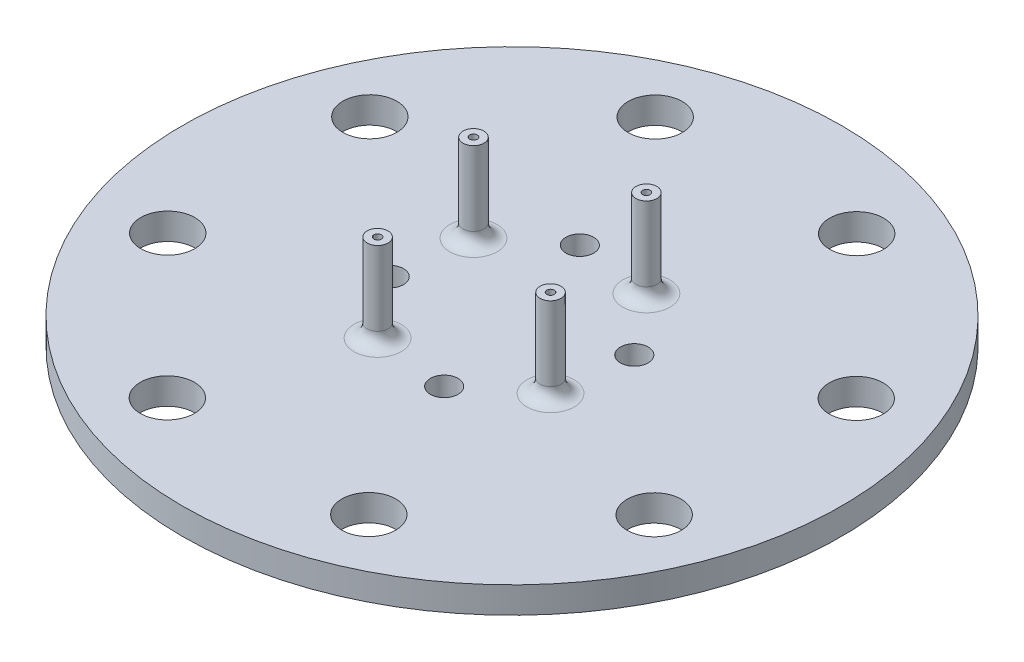
ISO-10303-21;
HEADER;
FILE_DESCRIPTION(('STEP AP214'),'2;1');
FILE_NAME('part.step','',(''),(''),'','','');
FILE_SCHEMA(('AUTOMOTIVE_DESIGN { 1 0 10303 214 1 1 1 1 }'));
ENDSEC;
DATA;
#1=APPLICATION_CONTEXT('core data for automotive mechanical design processes');
#2=APPLICATION_PROTOCOL_DEFINITION('international standard','automotive_design',2000,#1);
#3=PRODUCT_CONTEXT('',#1,'mechanical');
#4=PRODUCT('Part','Part','',(#3));
#5=PRODUCT_RELATED_PRODUCT_CATEGORY('part','',(#4));
#6=PRODUCT_DEFINITION_FORMATION('','',#4);
#7=PRODUCT_DEFINITION_CONTEXT('part definition',#1,'design');
#8=PRODUCT_DEFINITION('design','',#6,#7);
#9=PRODUCT_DEFINITION_SHAPE('','',#8);
#10=(LENGTH_UNIT() NAMED_UNIT(*) SI_UNIT(.MILLI.,.METRE.));
#11=(NAMED_UNIT(*) PLANE_ANGLE_UNIT() SI_UNIT($,.RADIAN.));
#12=(NAMED_UNIT(*) SI_UNIT($,.STERADIAN.) SOLID_ANGLE_UNIT());
#13=UNCERTAINTY_MEASURE_WITH_UNIT(LENGTH_MEASURE(1.E-05),#10,'distance_accuracy_value','');
#14=(GEOMETRIC_REPRESENTATION_CONTEXT(3) GLOBAL_UNCERTAINTY_ASSIGNED_CONTEXT((#13)) GLOBAL_UNIT_ASSIGNED_CONTEXT((#10,
#11,#12)) REPRESENTATION_CONTEXT('',''));
#15=CARTESIAN_POINT('',(0.,0.,0.));
#16=DIRECTION('',(0.,0.,1.));
#17=DIRECTION('',(1.,0.,0.));
#18=AXIS2_PLACEMENT_3D('',#15,#16,#17);
#19=CARTESIAN_POINT('',(3.63690117331167,3.,-6.55918820095629));
#20=DIRECTION('',(0.,1.,0.));
#21=DIRECTION('',(0.,0.,1.));
#22=AXIS2_PLACEMENT_3D('',#19,#20,#21);
#23=TOROIDAL_SURFACE('',#22,1.79375,1.);
#24=CARTESIAN_POINT('',(3.63690117331167,3.,-6.55918820095629));
#25=DIRECTION('',(0.,1.,0.));
#26=DIRECTION('',(0.,0.,1.));
#27=AXIS2_PLACEMENT_3D('',#24,#25,#26);
#28=CIRCLE('',#27,0.79375);
#29=CARTESIAN_POINT('',(3.63690117331167,3.,-5.76543820095629));
#30=VERTEX_POINT('',#29);
#31=EDGE_CURVE('E48',#30,#30,#28,.T.);
#32=ORIENTED_EDGE('',*,*,#31,.F.);
#33=EDGE_LOOP('',(#32));
#34=FACE_BOUND('',#33,.T.);
#35=CARTESIAN_POINT('',(3.63690117331167,2.,-6.55918820095629));
#36=DIRECTION('',(0.,1.,0.));
#37=DIRECTION('',(0.,0.,1.));
#38=AXIS2_PLACEMENT_3D('',#35,#36,#37);
#39=CIRCLE('',#38,1.79375);
#40=CARTESIAN_POINT('',(3.63690117331167,2.,-4.76543820095629));
#41=VERTEX_POINT('',#40);
#42=EDGE_CURVE('E10',#41,#41,#39,.F.);
#43=ORIENTED_EDGE('',*,*,#42,.F.);
#44=EDGE_LOOP('',(#43));
#45=FACE_BOUND('',#44,.T.);
#46=ADVANCED_FACE('F41',(#34,#45),#23,.F.);
#47=CARTESIAN_POINT('',(6.55918820095628,3.,3.63690117331169));
#48=DIRECTION('',(0.,1.,0.));
#49=DIRECTION('',(0.,0.,1.));
#50=AXIS2_PLACEMENT_3D('',#47,#48,#49);
#51=TOROIDAL_SURFACE('',#50,1.79375,1.);
#52=CARTESIAN_POINT('',(6.55918820095628,3.,3.63690117331169));
#53=DIRECTION('',(0.,1.,0.));
#54=DIRECTION('',(0.,0.,1.));
#55=AXIS2_PLACEMENT_3D('',#52,#53,#54);
#56=CIRCLE('',#55,0.79375);
#57=CARTESIAN_POINT('',(6.55918820095628,3.,4.43065117331169));
#58=VERTEX_POINT('',#57);
#59=EDGE_CURVE('E58',#58,#58,#56,.T.);
#60=ORIENTED_EDGE('',*,*,#59,.F.);
#61=EDGE_LOOP('',(#60));
#62=FACE_BOUND('',#61,.T.);
#63=CARTESIAN_POINT('',(6.55918820095628,2.,3.63690117331169));
#64=DIRECTION('',(0.,1.,0.));
#65=DIRECTION('',(0.,0.,1.));
#66=AXIS2_PLACEMENT_3D('',#63,#64,#65);
#67=CIRCLE('',#66,1.79375);
#68=CARTESIAN_POINT('',(6.55918820095628,2.,5.43065117331169));
#69=VERTEX_POINT('',#68);
#70=EDGE_CURVE('E53',#69,#69,#67,.F.);
#71=ORIENTED_EDGE('',*,*,#70,.F.);
#72=EDGE_LOOP('',(#71));
#73=FACE_BOUND('',#72,.T.);
#74=ADVANCED_FACE('F249',(#62,#73),#51,.F.);
#75=CARTESIAN_POINT('',(-3.63690117331162,3.,6.55918820095631));
#76=DIRECTION('',(0.,1.,0.));
#77=DIRECTION('',(0.,0.,1.));
#78=AXIS2_PLACEMENT_3D('',#75,#76,#77);
#79=TOROIDAL_SURFACE('',#78,1.79375,1.);
#80=CARTESIAN_POINT('',(-3.63690117331162,3.,6.55918820095631));
#81=DIRECTION('',(0.,1.,0.));
#82=DIRECTION('',(0.,0.,1.));
#83=AXIS2_PLACEMENT_3D('',#80,#81,#82);
#84=CIRCLE('',#83,0.793750000000001);
#85=CARTESIAN_POINT('',(-3.63690117331162,3.,7.35293820095631));
#86=VERTEX_POINT('',#85);
#87=EDGE_CURVE('E68',#86,#86,#84,.T.);
#88=ORIENTED_EDGE('',*,*,#87,.F.);
#89=EDGE_LOOP('',(#88));
#90=FACE_BOUND('',#89,.T.);
#91=CARTESIAN_POINT('',(-3.63690117331162,2.,6.55918820095631));
#92=DIRECTION('',(0.,1.,0.));
#93=DIRECTION('',(0.,0.,1.));
#94=AXIS2_PLACEMENT_3D('',#91,#92,#93);
#95=CIRCLE('',#94,1.79375);
#96=CARTESIAN_POINT('',(-3.63690117331162,2.,8.35293820095631));
#97=VERTEX_POINT('',#96);
#98=EDGE_CURVE('E64',#97,#97,#95,.F.);
#99=ORIENTED_EDGE('',*,*,#98,.F.);
#100=EDGE_LOOP('',(#99));
#101=FACE_BOUND('',#100,.T.);
#102=ADVANCED_FACE('F255',(#90,#101),#79,.F.);
#103=CARTESIAN_POINT('',(-6.5591882009563,3.,-3.63690117331165));
#104=DIRECTION('',(0.,1.,0.));
#105=DIRECTION('',(0.,0.,1.));
#106=AXIS2_PLACEMENT_3D('',#103,#104,#105);
#107=TOROIDAL_SURFACE('',#106,1.79375,1.);
#108=CARTESIAN_POINT('',(-6.5591882009563,3.,-3.63690117331165));
#109=DIRECTION('',(0.,1.,0.));
#110=DIRECTION('',(0.,0.,1.));
#111=AXIS2_PLACEMENT_3D('',#108,#109,#110);
#112=CIRCLE('',#111,0.79375);
#113=CARTESIAN_POINT('',(-6.5591882009563,3.,-2.84315117331165));
#114=VERTEX_POINT('',#113);
#115=EDGE_CURVE('E76',#114,#114,#112,.T.);
#116=ORIENTED_EDGE('',*,*,#115,.F.);
#117=EDGE_LOOP('',(#116));
#118=FACE_BOUND('',#117,.T.);
#119=CARTESIAN_POINT('',(-6.5591882009563,2.,-3.63690117331165));
#120=DIRECTION('',(0.,1.,0.));
#121=DIRECTION('',(0.,0.,1.));
#122=AXIS2_PLACEMENT_3D('',#119,#120,#121);
#123=CIRCLE('',#122,1.79375);
#124=CARTESIAN_POINT('',(-6.5591882009563,2.,-1.84315117331165));
#125=VERTEX_POINT('',#124);
#126=EDGE_CURVE('E72',#125,#125,#123,.F.);
#127=ORIENTED_EDGE('',*,*,#126,.F.);
#128=EDGE_LOOP('',(#127));
#129=FACE_BOUND('',#128,.T.);
#130=ADVANCED_FACE('F261',(#118,#129),#107,.F.);
#131=CARTESIAN_POINT('',(0.,2.,0.));
#132=DIRECTION('',(0.,-1.,0.));
#133=DIRECTION('',(0.,0.,-1.));
#134=AXIS2_PLACEMENT_3D('',#131,#132,#133);
#135=CYLINDRICAL_SURFACE('',#134,25.);
#136=CARTESIAN_POINT('',(0.,2.,0.));
#137=DIRECTION('',(0.,1.,0.));
#138=DIRECTION('',(0.,0.,1.));
#139=AXIS2_PLACEMENT_3D('',#136,#137,#138);
#140=CIRCLE('',#139,25.);
#141=CARTESIAN_POINT('',(0.,2.,25.));
#142=VERTEX_POINT('',#141);
#143=EDGE_CURVE('E80',#142,#142,#140,.T.);
#144=ORIENTED_EDGE('',*,*,#143,.F.);
#145=EDGE_LOOP('',(#144));
#146=FACE_BOUND('',#145,.T.);
#147=CARTESIAN_POINT('',(0.,0.,0.));
#148=DIRECTION('',(0.,1.,0.));
#149=DIRECTION('',(0.,0.,1.));
#150=AXIS2_PLACEMENT_3D('',#147,#148,#149);
#151=CIRCLE('',#150,25.);
#152=CARTESIAN_POINT('',(0.,0.,25.));
#153=VERTEX_POINT('',#152);
#154=EDGE_CURVE('E81',#153,#153,#151,.T.);
#155=ORIENTED_EDGE('',*,*,#154,.T.);
#156=EDGE_LOOP('',(#155));
#157=FACE_BOUND('',#156,.T.);
#158=ADVANCED_FACE('F269',(#146,#157),#135,.T.);
#159=CARTESIAN_POINT('',(0.,2.,0.));
#160=DIRECTION('',(0.,1.,0.));
#161=DIRECTION('',(0.,0.,1.));
#162=AXIS2_PLACEMENT_3D('',#159,#160,#161);
#163=PLANE('',#162);
#164=ORIENTED_EDGE('',*,*,#42,.T.);
#165=EDGE_LOOP('',(#164));
#166=FACE_BOUND('',#165,.T.);
#167=ORIENTED_EDGE('',*,*,#70,.T.);
#168=EDGE_LOOP('',(#167));
#169=FACE_BOUND('',#168,.T.);
#170=ORIENTED_EDGE('',*,*,#98,.T.);
#171=EDGE_LOOP('',(#170));
#172=FACE_BOUND('',#171,.T.);
#173=ORIENTED_EDGE('',*,*,#126,.T.);
#174=EDGE_LOOP('',(#173));
#175=FACE_BOUND('',#174,.T.);
#176=CARTESIAN_POINT('',(-7.68064256948644,2.,18.4663946053315));
#177=DIRECTION('',(0.,-1.,0.));
#178=DIRECTION('',(0.,0.,-1.));
#179=AXIS2_PLACEMENT_3D('',#176,#177,#178);
#180=CIRCLE('',#179,2.05);
#181=CARTESIAN_POINT('',(-7.68064256948644,2.,16.4163946053315));
#182=VERTEX_POINT('',#181);
#183=EDGE_CURVE('E125',#182,#182,#180,.T.);
#184=ORIENTED_EDGE('',*,*,#183,.T.);
#185=EDGE_LOOP('',(#184));
#186=FACE_BOUND('',#185,.T.);
#187=CARTESIAN_POINT('',(7.62667840474221,2.,18.488747294251));
#188=DIRECTION('',(0.,-1.,0.));
#189=DIRECTION('',(0.,0.,-1.));
#190=AXIS2_PLACEMENT_3D('',#187,#188,#189);
#191=CIRCLE('',#190,2.05);
#192=CARTESIAN_POINT('',(7.62667840474221,2.,16.438747294251));
#193=VERTEX_POINT('',#192);
#194=EDGE_CURVE('E150',#193,#193,#191,.T.);
#195=ORIENTED_EDGE('',*,*,#194,.T.);
#196=EDGE_LOOP('',(#195));
#197=FACE_BOUND('',#196,.T.);
#198=CARTESIAN_POINT('',(18.4663946053311,2.,7.68064256948754));
#199=DIRECTION('',(0.,-1.,0.));
#200=DIRECTION('',(0.,0.,-1.));
#201=AXIS2_PLACEMENT_3D('',#198,#199,#200);
#202=CIRCLE('',#201,2.05);
#203=CARTESIAN_POINT('',(18.4663946053311,2.,5.63064256948754));
#204=VERTEX_POINT('',#203);
#205=EDGE_CURVE('E142',#204,#204,#202,.T.);
#206=ORIENTED_EDGE('',*,*,#205,.T.);
#207=EDGE_LOOP('',(#206));
#208=FACE_BOUND('',#207,.T.);
#209=CARTESIAN_POINT('',(18.4887472942505,2.,-7.62667840474111));
#210=DIRECTION('',(0.,-1.,0.));
#211=DIRECTION('',(0.,0.,-1.));
#212=AXIS2_PLACEMENT_3D('',#209,#210,#211);
#213=CIRCLE('',#212,2.05);
#214=CARTESIAN_POINT('',(18.4887472942505,2.,-9.67667840474111));
#215=VERTEX_POINT('',#214);
#216=EDGE_CURVE('E133',#215,#215,#213,.T.);
#217=ORIENTED_EDGE('',*,*,#216,.T.);
#218=EDGE_LOOP('',(#217));
#219=FACE_BOUND('',#218,.T.);
#220=CARTESIAN_POINT('',(7.6806425694871,2.,-18.46639460533));
#221=DIRECTION('',(0.,-1.,0.));
#222=DIRECTION('',(0.,0.,-1.));
#223=AXIS2_PLACEMENT_3D('',#220,#221,#222);
#224=CIRCLE('',#223,2.05);
#225=CARTESIAN_POINT('',(7.6806425694871,2.,-20.51639460533));
#226=VERTEX_POINT('',#225);
#227=EDGE_CURVE('E134',#226,#226,#224,.T.);
#228=ORIENTED_EDGE('',*,*,#227,.T.);
#229=EDGE_LOOP('',(#228));
#230=FACE_BOUND('',#229,.T.);
#231=CARTESIAN_POINT('',(-7.62667840474155,2.,-18.4887472942494));
#232=DIRECTION('',(0.,-1.,0.));
#233=DIRECTION('',(0.,0.,-1.));
#234=AXIS2_PLACEMENT_3D('',#231,#232,#233);
#235=CIRCLE('',#234,2.05);
#236=CARTESIAN_POINT('',(-7.62667840474155,2.,-20.5387472942494));
#237=VERTEX_POINT('',#236);
#238=EDGE_CURVE('E174',#237,#237,#235,.T.);
#239=ORIENTED_EDGE('',*,*,#238,.T.);
#240=EDGE_LOOP('',(#239));
#241=FACE_BOUND('',#240,.T.);
#242=CARTESIAN_POINT('',(-18.4663946053304,2.,-7.68064256948599));
#243=DIRECTION('',(0.,-1.,0.));
#244=DIRECTION('',(0.,0.,-1.));
#245=AXIS2_PLACEMENT_3D('',#242,#243,#244);
#246=CIRCLE('',#245,2.05);
#247=CARTESIAN_POINT('',(-18.4663946053304,2.,-9.73064256948599));
#248=VERTEX_POINT('',#247);
#249=EDGE_CURVE('E165',#248,#248,#246,.T.);
#250=ORIENTED_EDGE('',*,*,#249,.T.);
#251=EDGE_LOOP('',(#250));
#252=FACE_BOUND('',#251,.T.);
#253=CARTESIAN_POINT('',(-18.4887472942499,2.,7.62667840474266));
#254=DIRECTION('',(0.,-1.,0.));
#255=DIRECTION('',(0.,0.,-1.));
#256=AXIS2_PLACEMENT_3D('',#253,#254,#255);
#257=CIRCLE('',#256,2.05);
#258=CARTESIAN_POINT('',(-18.4887472942499,2.,5.57667840474266));
#259=VERTEX_POINT('',#258);
#260=EDGE_CURVE('E110',#259,#259,#257,.T.);
#261=ORIENTED_EDGE('',*,*,#260,.T.);
#262=EDGE_LOOP('',(#261));
#263=FACE_BOUND('',#262,.T.);
#264=CARTESIAN_POINT('',(-7.20972393812874,2.,2.06636897382066));
#265=DIRECTION('',(0.,1.,0.));
#266=DIRECTION('',(0.,0.,1.));
#267=AXIS2_PLACEMENT_3D('',#264,#265,#266);
#268=CIRCLE('',#267,1.05);
#269=CARTESIAN_POINT('',(-7.20972393812874,2.,3.11636897382066));
#270=VERTEX_POINT('',#269);
#271=EDGE_CURVE('E105',#270,#270,#268,.T.);
#272=ORIENTED_EDGE('',*,*,#271,.F.);
#273=EDGE_LOOP('',(#272));
#274=FACE_BOUND('',#273,.T.);
#275=CARTESIAN_POINT('',(2.06636897382105,2.,7.20972393812896));
#276=DIRECTION('',(0.,1.,0.));
#277=DIRECTION('',(0.,0.,1.));
#278=AXIS2_PLACEMENT_3D('',#275,#276,#277);
#279=CIRCLE('',#278,1.05);
#280=CARTESIAN_POINT('',(2.06636897382105,2.,8.25972393812896));
#281=VERTEX_POINT('',#280);
#282=EDGE_CURVE('E114',#281,#281,#279,.T.);
#283=ORIENTED_EDGE('',*,*,#282,.F.);
#284=EDGE_LOOP('',(#283));
#285=FACE_BOUND('',#284,.T.);
#286=CARTESIAN_POINT('',(7.20972393812935,2.,-2.06636897382083));
#287=DIRECTION('',(0.,1.,0.));
#288=DIRECTION('',(0.,0.,1.));
#289=AXIS2_PLACEMENT_3D('',#286,#287,#288);
#290=CIRCLE('',#289,1.05);
#291=CARTESIAN_POINT('',(7.20972393812935,2.,-1.01636897382083));
#292=VERTEX_POINT('',#291);
#293=EDGE_CURVE('E97',#292,#292,#290,.T.);
#294=ORIENTED_EDGE('',*,*,#293,.F.);
#295=EDGE_LOOP('',(#294));
#296=FACE_BOUND('',#295,.T.);
#297=CARTESIAN_POINT('',(-2.06636897382044,2.,-7.20972393812913));
#298=DIRECTION('',(0.,1.,0.));
#299=DIRECTION('',(0.,0.,1.));
#300=AXIS2_PLACEMENT_3D('',#297,#298,#299);
#301=CIRCLE('',#300,1.05);
#302=CARTESIAN_POINT('',(-2.06636897382044,2.,-6.15972393812913));
#303=VERTEX_POINT('',#302);
#304=EDGE_CURVE('E89',#303,#303,#301,.T.);
#305=ORIENTED_EDGE('',*,*,#304,.F.);
#306=EDGE_LOOP('',(#305));
#307=FACE_BOUND('',#306,.T.);
#308=ORIENTED_EDGE('',*,*,#143,.T.);
#309=EDGE_LOOP('',(#308));
#310=FACE_BOUND('',#309,.T.);
#311=ADVANCED_FACE('F273',(#166,#169,#172,#175,#186,#197,#208,#219,#230,#241,#252,#263,#274,
#285,#296,#307,#310),#163,.T.);
#312=CARTESIAN_POINT('',(0.,0.,0.));
#313=DIRECTION('',(0.,1.,0.));
#314=DIRECTION('',(0.,0.,1.));
#315=AXIS2_PLACEMENT_3D('',#312,#313,#314);
#316=PLANE('',#315);
#317=CARTESIAN_POINT('',(-7.68064256948644,0.,18.4663946053315));
#318=DIRECTION('',(0.,-1.,0.));
#319=DIRECTION('',(0.,0.,-1.));
#320=AXIS2_PLACEMENT_3D('',#317,#318,#319);
#321=CIRCLE('',#320,2.05);
#322=CARTESIAN_POINT('',(-7.68064256948644,0.,16.4163946053315));
#323=VERTEX_POINT('',#322);
#324=EDGE_CURVE('E154',#323,#323,#321,.T.);
#325=ORIENTED_EDGE('',*,*,#324,.F.);
#326=EDGE_LOOP('',(#325));
#327=FACE_BOUND('',#326,.T.);
#328=CARTESIAN_POINT('',(7.62667840474221,0.,18.488747294251));
#329=DIRECTION('',(0.,-1.,0.));
#330=DIRECTION('',(0.,0.,-1.));
#331=AXIS2_PLACEMENT_3D('',#328,#329,#330);
#332=CIRCLE('',#331,2.05);
#333=CARTESIAN_POINT('',(7.62667840474221,0.,16.438747294251));
#334=VERTEX_POINT('',#333);
#335=EDGE_CURVE('E146',#334,#334,#332,.T.);
#336=ORIENTED_EDGE('',*,*,#335,.F.);
#337=EDGE_LOOP('',(#336));
#338=FACE_BOUND('',#337,.T.);
#339=CARTESIAN_POINT('',(18.4663946053311,0.,7.68064256948754));
#340=DIRECTION('',(0.,-1.,0.));
#341=DIRECTION('',(0.,0.,-1.));
#342=AXIS2_PLACEMENT_3D('',#339,#340,#341);
#343=CIRCLE('',#342,2.05);
#344=CARTESIAN_POINT('',(18.4663946053311,0.,5.63064256948754));
#345=VERTEX_POINT('',#344);
#346=EDGE_CURVE('E138',#345,#345,#343,.T.);
#347=ORIENTED_EDGE('',*,*,#346,.F.);
#348=EDGE_LOOP('',(#347));
#349=FACE_BOUND('',#348,.T.);
#350=CARTESIAN_POINT('',(18.4887472942505,0.,-7.62667840474111));
#351=DIRECTION('',(0.,-1.,0.));
#352=DIRECTION('',(0.,0.,-1.));
#353=AXIS2_PLACEMENT_3D('',#350,#351,#352);
#354=CIRCLE('',#353,2.05);
#355=CARTESIAN_POINT('',(18.4887472942505,0.,-9.67667840474111));
#356=VERTEX_POINT('',#355);
#357=EDGE_CURVE('E129',#356,#356,#354,.T.);
#358=ORIENTED_EDGE('',*,*,#357,.F.);
#359=EDGE_LOOP('',(#358));
#360=FACE_BOUND('',#359,.T.);
#361=CARTESIAN_POINT('',(7.6806425694871,0.,-18.46639460533));
#362=DIRECTION('',(0.,-1.,0.));
#363=DIRECTION('',(0.,0.,-1.));
#364=AXIS2_PLACEMENT_3D('',#361,#362,#363);
#365=CIRCLE('',#364,2.05);
#366=CARTESIAN_POINT('',(7.6806425694871,0.,-20.51639460533));
#367=VERTEX_POINT('',#366);
#368=EDGE_CURVE('E178',#367,#367,#365,.T.);
#369=ORIENTED_EDGE('',*,*,#368,.F.);
#370=EDGE_LOOP('',(#369));
#371=FACE_BOUND('',#370,.T.);
#372=CARTESIAN_POINT('',(-7.62667840474155,0.,-18.4887472942494));
#373=DIRECTION('',(0.,-1.,0.));
#374=DIRECTION('',(0.,0.,-1.));
#375=AXIS2_PLACEMENT_3D('',#372,#373,#374);
#376=CIRCLE('',#375,2.05);
#377=CARTESIAN_POINT('',(-7.62667840474155,0.,-20.5387472942494));
#378=VERTEX_POINT('',#377);
#379=EDGE_CURVE('E170',#378,#378,#376,.T.);
#380=ORIENTED_EDGE('',*,*,#379,.F.);
#381=EDGE_LOOP('',(#380));
#382=FACE_BOUND('',#381,.T.);
#383=CARTESIAN_POINT('',(-18.4663946053304,0.,-7.68064256948599));
#384=DIRECTION('',(0.,-1.,0.));
#385=DIRECTION('',(0.,0.,-1.));
#386=AXIS2_PLACEMENT_3D('',#383,#384,#385);
#387=CIRCLE('',#386,2.05);
#388=CARTESIAN_POINT('',(-18.4663946053304,0.,-9.73064256948599));
#389=VERTEX_POINT('',#388);
#390=EDGE_CURVE('E161',#389,#389,#387,.T.);
#391=ORIENTED_EDGE('',*,*,#390,.F.);
#392=EDGE_LOOP('',(#391));
#393=FACE_BOUND('',#392,.T.);
#394=CARTESIAN_POINT('',(-18.4887472942499,0.,7.62667840474266));
#395=DIRECTION('',(0.,-1.,0.));
#396=DIRECTION('',(0.,0.,-1.));
#397=AXIS2_PLACEMENT_3D('',#394,#395,#396);
#398=CIRCLE('',#397,2.05);
#399=CARTESIAN_POINT('',(-18.4887472942499,0.,5.57667840474266));
#400=VERTEX_POINT('',#399);
#401=EDGE_CURVE('E121',#400,#400,#398,.T.);
#402=ORIENTED_EDGE('',*,*,#401,.F.);
#403=EDGE_LOOP('',(#402));
#404=FACE_BOUND('',#403,.T.);
#405=CARTESIAN_POINT('',(-7.20972393812874,0.,2.06636897382066));
#406=DIRECTION('',(0.,1.,0.));
#407=DIRECTION('',(0.,0.,1.));
#408=AXIS2_PLACEMENT_3D('',#405,#406,#407);
#409=CIRCLE('',#408,1.05);
#410=CARTESIAN_POINT('',(-7.20972393812874,0.,3.11636897382066));
#411=VERTEX_POINT('',#410);
#412=EDGE_CURVE('E109',#411,#411,#409,.T.);
#413=ORIENTED_EDGE('',*,*,#412,.T.);
#414=EDGE_LOOP('',(#413));
#415=FACE_BOUND('',#414,.T.);
#416=CARTESIAN_POINT('',(2.06636897382105,0.,7.20972393812896));
#417=DIRECTION('',(0.,1.,0.));
#418=DIRECTION('',(0.,0.,1.));
#419=AXIS2_PLACEMENT_3D('',#416,#417,#418);
#420=CIRCLE('',#419,1.05);
#421=CARTESIAN_POINT('',(2.06636897382105,0.,8.25972393812896));
#422=VERTEX_POINT('',#421);
#423=EDGE_CURVE('E101',#422,#422,#420,.T.);
#424=ORIENTED_EDGE('',*,*,#423,.T.);
#425=EDGE_LOOP('',(#424));
#426=FACE_BOUND('',#425,.T.);
#427=CARTESIAN_POINT('',(7.20972393812935,0.,-2.06636897382083));
#428=DIRECTION('',(0.,1.,0.));
#429=DIRECTION('',(0.,0.,1.));
#430=AXIS2_PLACEMENT_3D('',#427,#428,#429);
#431=CIRCLE('',#430,1.05);
#432=CARTESIAN_POINT('',(7.20972393812935,0.,-1.01636897382083));
#433=VERTEX_POINT('',#432);
#434=EDGE_CURVE('E93',#433,#433,#431,.T.);
#435=ORIENTED_EDGE('',*,*,#434,.T.);
#436=EDGE_LOOP('',(#435));
#437=FACE_BOUND('',#436,.T.);
#438=CARTESIAN_POINT('',(-2.06636897382044,0.,-7.20972393812913));
#439=DIRECTION('',(0.,1.,0.));
#440=DIRECTION('',(0.,0.,1.));
#441=AXIS2_PLACEMENT_3D('',#438,#439,#440);
#442=CIRCLE('',#441,1.05);
#443=CARTESIAN_POINT('',(-2.06636897382044,0.,-6.15972393812913));
#444=VERTEX_POINT('',#443);
#445=EDGE_CURVE('E85',#444,#444,#442,.T.);
#446=ORIENTED_EDGE('',*,*,#445,.T.);
#447=EDGE_LOOP('',(#446));
#448=FACE_BOUND('',#447,.T.);
#449=ORIENTED_EDGE('',*,*,#154,.F.);
#450=EDGE_LOOP('',(#449));
#451=FACE_BOUND('',#450,.T.);
#452=CARTESIAN_POINT('',(-3.63690117331162,0.,6.55918820095631));
#453=DIRECTION('',(0.,1.,0.));
#454=DIRECTION('',(0.,0.,1.));
#455=AXIS2_PLACEMENT_3D('',#452,#453,#454);
#456=CIRCLE('',#455,0.285750000000001);
#457=CARTESIAN_POINT('',(-3.63690117331162,0.,6.84493820095631));
#458=VERTEX_POINT('',#457);
#459=EDGE_CURVE('E189',#458,#458,#456,.T.);
#460=ORIENTED_EDGE('',*,*,#459,.T.);
#461=EDGE_LOOP('',(#460));
#462=FACE_BOUND('',#461,.T.);
#463=CARTESIAN_POINT('',(-6.5591882009563,0.,-3.63690117331165));
#464=DIRECTION('',(0.,1.,0.));
#465=DIRECTION('',(0.,0.,1.));
#466=AXIS2_PLACEMENT_3D('',#463,#464,#465);
#467=CIRCLE('',#466,0.28575);
#468=CARTESIAN_POINT('',(-6.5591882009563,0.,-3.35115117331165));
#469=VERTEX_POINT('',#468);
#470=EDGE_CURVE('E193',#469,#469,#467,.T.);
#471=ORIENTED_EDGE('',*,*,#470,.T.);
#472=EDGE_LOOP('',(#471));
#473=FACE_BOUND('',#472,.T.);
#474=CARTESIAN_POINT('',(6.55918820095628,0.,3.63690117331169));
#475=DIRECTION('',(0.,1.,0.));
#476=DIRECTION('',(0.,0.,1.));
#477=AXIS2_PLACEMENT_3D('',#474,#475,#476);
#478=CIRCLE('',#477,0.28575);
#479=CARTESIAN_POINT('',(6.55918820095628,0.,3.92265117331169));
#480=VERTEX_POINT('',#479);
#481=EDGE_CURVE('E208',#480,#480,#478,.T.);
#482=ORIENTED_EDGE('',*,*,#481,.T.);
#483=EDGE_LOOP('',(#482));
#484=FACE_BOUND('',#483,.T.);
#485=CARTESIAN_POINT('',(3.63690117331167,0.,-6.55918820095629));
#486=DIRECTION('',(0.,1.,0.));
#487=DIRECTION('',(0.,0.,1.));
#488=AXIS2_PLACEMENT_3D('',#485,#486,#487);
#489=CIRCLE('',#488,0.28575);
#490=CARTESIAN_POINT('',(3.63690117331167,0.,-6.27343820095629));
#491=VERTEX_POINT('',#490);
#492=EDGE_CURVE('E220',#491,#491,#489,.T.);
#493=ORIENTED_EDGE('',*,*,#492,.T.);
#494=EDGE_LOOP('',(#493));
#495=FACE_BOUND('',#494,.T.);
#496=ADVANCED_FACE('F275',(#327,#338,#349,#360,#371,#382,#393,#404,#415,#426,#437,#448,#451,
#462,#473,#484,#495),#316,.F.);
#497=CARTESIAN_POINT('',(-2.06636897382044,0.,-7.20972393812913));
#498=DIRECTION('',(0.,1.,0.));
#499=DIRECTION('',(0.,0.,1.));
#500=AXIS2_PLACEMENT_3D('',#497,#498,#499);
#501=CYLINDRICAL_SURFACE('',#500,1.05);
#502=ORIENTED_EDGE('',*,*,#445,.F.);
#503=EDGE_LOOP('',(#502));
#504=FACE_BOUND('',#503,.T.);
#505=ORIENTED_EDGE('',*,*,#304,.T.);
#506=EDGE_LOOP('',(#505));
#507=FACE_BOUND('',#506,.T.);
#508=ADVANCED_FACE('F278',(#504,#507),#501,.F.);
#509=CARTESIAN_POINT('',(7.20972393812935,0.,-2.06636897382083));
#510=DIRECTION('',(0.,1.,0.));
#511=DIRECTION('',(0.,0.,1.));
#512=AXIS2_PLACEMENT_3D('',#509,#510,#511);
#513=CYLINDRICAL_SURFACE('',#512,1.05);
#514=ORIENTED_EDGE('',*,*,#434,.F.);
#515=EDGE_LOOP('',(#514));
#516=FACE_BOUND('',#515,.T.);
#517=ORIENTED_EDGE('',*,*,#293,.T.);
#518=EDGE_LOOP('',(#517));
#519=FACE_BOUND('',#518,.T.);
#520=ADVANCED_FACE('F284',(#516,#519),#513,.F.);
#521=CARTESIAN_POINT('',(2.06636897382105,0.,7.20972393812896));
#522=DIRECTION('',(0.,1.,0.));
#523=DIRECTION('',(0.,0.,1.));
#524=AXIS2_PLACEMENT_3D('',#521,#522,#523);
#525=CYLINDRICAL_SURFACE('',#524,1.05);
#526=ORIENTED_EDGE('',*,*,#423,.F.);
#527=EDGE_LOOP('',(#526));
#528=FACE_BOUND('',#527,.T.);
#529=ORIENTED_EDGE('',*,*,#282,.T.);
#530=EDGE_LOOP('',(#529));
#531=FACE_BOUND('',#530,.T.);
#532=ADVANCED_FACE('F288',(#528,#531),#525,.F.);
#533=CARTESIAN_POINT('',(-7.20972393812874,0.,2.06636897382066));
#534=DIRECTION('',(0.,1.,0.));
#535=DIRECTION('',(0.,0.,1.));
#536=AXIS2_PLACEMENT_3D('',#533,#534,#535);
#537=CYLINDRICAL_SURFACE('',#536,1.05);
#538=ORIENTED_EDGE('',*,*,#412,.F.);
#539=EDGE_LOOP('',(#538));
#540=FACE_BOUND('',#539,.T.);
#541=ORIENTED_EDGE('',*,*,#271,.T.);
#542=EDGE_LOOP('',(#541));
#543=FACE_BOUND('',#542,.T.);
#544=ADVANCED_FACE('F290',(#540,#543),#537,.F.);
#545=CARTESIAN_POINT('',(-18.4887472942499,2.,7.62667840474266));
#546=DIRECTION('',(0.,-1.,0.));
#547=DIRECTION('',(0.,0.,-1.));
#548=AXIS2_PLACEMENT_3D('',#545,#546,#547);
#549=CYLINDRICAL_SURFACE('',#548,2.05);
#550=ORIENTED_EDGE('',*,*,#260,.F.);
#551=EDGE_LOOP('',(#550));
#552=FACE_BOUND('',#551,.T.);
#553=ORIENTED_EDGE('',*,*,#401,.T.);
#554=EDGE_LOOP('',(#553));
#555=FACE_BOUND('',#554,.T.);
#556=ADVANCED_FACE('F293',(#552,#555),#549,.F.);
#557=CARTESIAN_POINT('',(-18.4663946053304,2.,-7.68064256948599));
#558=DIRECTION('',(0.,-1.,0.));
#559=DIRECTION('',(0.,0.,-1.));
#560=AXIS2_PLACEMENT_3D('',#557,#558,#559);
#561=CYLINDRICAL_SURFACE('',#560,2.05);
#562=ORIENTED_EDGE('',*,*,#249,.F.);
#563=EDGE_LOOP('',(#562));
#564=FACE_BOUND('',#563,.T.);
#565=ORIENTED_EDGE('',*,*,#390,.T.);
#566=EDGE_LOOP('',(#565));
#567=FACE_BOUND('',#566,.T.);
#568=ADVANCED_FACE('F300',(#564,#567),#561,.F.);
#569=CARTESIAN_POINT('',(-7.62667840474155,2.,-18.4887472942494));
#570=DIRECTION('',(0.,-1.,0.));
#571=DIRECTION('',(0.,0.,-1.));
#572=AXIS2_PLACEMENT_3D('',#569,#570,#571);
#573=CYLINDRICAL_SURFACE('',#572,2.05);
#574=ORIENTED_EDGE('',*,*,#238,.F.);
#575=EDGE_LOOP('',(#574));
#576=FACE_BOUND('',#575,.T.);
#577=ORIENTED_EDGE('',*,*,#379,.T.);
#578=EDGE_LOOP('',(#577));
#579=FACE_BOUND('',#578,.T.);
#580=ADVANCED_FACE('F322',(#576,#579),#573,.F.);
#581=CARTESIAN_POINT('',(7.6806425694871,2.,-18.46639460533));
#582=DIRECTION('',(0.,-1.,0.));
#583=DIRECTION('',(0.,0.,-1.));
#584=AXIS2_PLACEMENT_3D('',#581,#582,#583);
#585=CYLINDRICAL_SURFACE('',#584,2.05);
#586=ORIENTED_EDGE('',*,*,#227,.F.);
#587=EDGE_LOOP('',(#586));
#588=FACE_BOUND('',#587,.T.);
#589=ORIENTED_EDGE('',*,*,#368,.T.);
#590=EDGE_LOOP('',(#589));
#591=FACE_BOUND('',#590,.T.);
#592=ADVANCED_FACE('F306',(#588,#591),#585,.F.);
#593=CARTESIAN_POINT('',(18.4887472942505,2.,-7.62667840474111));
#594=DIRECTION('',(0.,-1.,0.));
#595=DIRECTION('',(0.,0.,-1.));
#596=AXIS2_PLACEMENT_3D('',#593,#594,#595);
#597=CYLINDRICAL_SURFACE('',#596,2.05);
#598=ORIENTED_EDGE('',*,*,#216,.F.);
#599=EDGE_LOOP('',(#598));
#600=FACE_BOUND('',#599,.T.);
#601=ORIENTED_EDGE('',*,*,#357,.T.);
#602=EDGE_LOOP('',(#601));
#603=FACE_BOUND('',#602,.T.);
#604=ADVANCED_FACE('F302',(#600,#603),#597,.F.);
#605=CARTESIAN_POINT('',(18.4663946053311,2.,7.68064256948754));
#606=DIRECTION('',(0.,-1.,0.));
#607=DIRECTION('',(0.,0.,-1.));
#608=AXIS2_PLACEMENT_3D('',#605,#606,#607);
#609=CYLINDRICAL_SURFACE('',#608,2.05);
#610=ORIENTED_EDGE('',*,*,#205,.F.);
#611=EDGE_LOOP('',(#610));
#612=FACE_BOUND('',#611,.T.);
#613=ORIENTED_EDGE('',*,*,#346,.T.);
#614=EDGE_LOOP('',(#613));
#615=FACE_BOUND('',#614,.T.);
#616=ADVANCED_FACE('F305',(#612,#615),#609,.F.);
#617=CARTESIAN_POINT('',(7.62667840474221,2.,18.488747294251));
#618=DIRECTION('',(0.,-1.,0.));
#619=DIRECTION('',(0.,0.,-1.));
#620=AXIS2_PLACEMENT_3D('',#617,#618,#619);
#621=CYLINDRICAL_SURFACE('',#620,2.05);
#622=ORIENTED_EDGE('',*,*,#194,.F.);
#623=EDGE_LOOP('',(#622));
#624=FACE_BOUND('',#623,.T.);
#625=ORIENTED_EDGE('',*,*,#335,.T.);
#626=EDGE_LOOP('',(#625));
#627=FACE_BOUND('',#626,.T.);
#628=ADVANCED_FACE('F310',(#624,#627),#621,.F.);
#629=CARTESIAN_POINT('',(-7.68064256948644,2.,18.4663946053315));
#630=DIRECTION('',(0.,-1.,0.));
#631=DIRECTION('',(0.,0.,-1.));
#632=AXIS2_PLACEMENT_3D('',#629,#630,#631);
#633=CYLINDRICAL_SURFACE('',#632,2.05);
#634=ORIENTED_EDGE('',*,*,#183,.F.);
#635=EDGE_LOOP('',(#634));
#636=FACE_BOUND('',#635,.T.);
#637=ORIENTED_EDGE('',*,*,#324,.T.);
#638=EDGE_LOOP('',(#637));
#639=FACE_BOUND('',#638,.T.);
#640=ADVANCED_FACE('F314',(#636,#639),#633,.F.);
#641=CARTESIAN_POINT('',(-3.63690117331162,8.64,6.55918820095631));
#642=DIRECTION('',(0.,1.,0.));
#643=DIRECTION('',(0.,0.,1.));
#644=AXIS2_PLACEMENT_3D('',#641,#642,#643);
#645=PLANE('',#644);
#646=CARTESIAN_POINT('',(-3.63690117331162,8.64,6.55918820095631));
#647=DIRECTION('',(0.,1.,0.));
#648=DIRECTION('',(0.,0.,1.));
#649=AXIS2_PLACEMENT_3D('',#646,#647,#648);
#650=CIRCLE('',#649,0.793750000000001);
#651=CARTESIAN_POINT('',(-3.63690117331162,8.64,7.35293820095631));
#652=VERTEX_POINT('',#651);
#653=EDGE_CURVE('E166',#652,#652,#650,.T.);
#654=ORIENTED_EDGE('',*,*,#653,.T.);
#655=EDGE_LOOP('',(#654));
#656=FACE_BOUND('',#655,.T.);
#657=CARTESIAN_POINT('',(-3.63690117331162,8.64,6.55918820095631));
#658=DIRECTION('',(0.,1.,0.));
#659=DIRECTION('',(0.,0.,1.));
#660=AXIS2_PLACEMENT_3D('',#657,#658,#659);
#661=CIRCLE('',#660,0.285750000000001);
#662=CARTESIAN_POINT('',(-3.63690117331162,8.64,6.84493820095631));
#663=VERTEX_POINT('',#662);
#664=EDGE_CURVE('E188',#663,#663,#661,.T.);
#665=ORIENTED_EDGE('',*,*,#664,.F.);
#666=EDGE_LOOP('',(#665));
#667=FACE_BOUND('',#666,.T.);
#668=ADVANCED_FACE('F318',(#656,#667),#645,.T.);
#669=CARTESIAN_POINT('',(-3.63690117331162,8.64,6.55918820095631));
#670=DIRECTION('',(0.,-1.,0.));
#671=DIRECTION('',(0.,0.,-1.));
#672=AXIS2_PLACEMENT_3D('',#669,#670,#671);
#673=CYLINDRICAL_SURFACE('',#672,0.793750000000001);
#674=ORIENTED_EDGE('',*,*,#87,.T.);
#675=EDGE_LOOP('',(#674));
#676=FACE_BOUND('',#675,.T.);
#677=ORIENTED_EDGE('',*,*,#653,.F.);
#678=EDGE_LOOP('',(#677));
#679=FACE_BOUND('',#678,.T.);
#680=ADVANCED_FACE('F330',(#676,#679),#673,.T.);
#681=CARTESIAN_POINT('',(-3.63690117331162,8.64,6.55918820095631));
#682=DIRECTION('',(0.,-1.,0.));
#683=DIRECTION('',(0.,0.,-1.));
#684=AXIS2_PLACEMENT_3D('',#681,#682,#683);
#685=CYLINDRICAL_SURFACE('',#684,0.285750000000001);
#686=ORIENTED_EDGE('',*,*,#664,.T.);
#687=EDGE_LOOP('',(#686));
#688=FACE_BOUND('',#687,.T.);
#689=ORIENTED_EDGE('',*,*,#459,.F.);
#690=EDGE_LOOP('',(#689));
#691=FACE_BOUND('',#690,.T.);
#692=ADVANCED_FACE('F333',(#688,#691),#685,.F.);
#693=CARTESIAN_POINT('',(-6.5591882009563,8.64,-3.63690117331165));
#694=DIRECTION('',(0.,1.,0.));
#695=DIRECTION('',(0.,0.,1.));
#696=AXIS2_PLACEMENT_3D('',#693,#694,#695);
#697=PLANE('',#696);
#698=CARTESIAN_POINT('',(-6.5591882009563,8.64,-3.63690117331165));
#699=DIRECTION('',(0.,1.,0.));
#700=DIRECTION('',(0.,0.,1.));
#701=AXIS2_PLACEMENT_3D('',#698,#699,#700);
#702=CIRCLE('',#701,0.79375);
#703=CARTESIAN_POINT('',(-6.5591882009563,8.64,-2.84315117331165));
#704=VERTEX_POINT('',#703);
#705=EDGE_CURVE('E201',#704,#704,#702,.T.);
#706=ORIENTED_EDGE('',*,*,#705,.T.);
#707=EDGE_LOOP('',(#706));
#708=FACE_BOUND('',#707,.T.);
#709=CARTESIAN_POINT('',(-6.5591882009563,8.64,-3.63690117331165));
#710=DIRECTION('',(0.,1.,0.));
#711=DIRECTION('',(0.,0.,1.));
#712=AXIS2_PLACEMENT_3D('',#709,#710,#711);
#713=CIRCLE('',#712,0.28575);
#714=CARTESIAN_POINT('',(-6.5591882009563,8.64,-3.35115117331165));
#715=VERTEX_POINT('',#714);
#716=EDGE_CURVE('E197',#715,#715,#713,.T.);
#717=ORIENTED_EDGE('',*,*,#716,.F.);
#718=EDGE_LOOP('',(#717));
#719=FACE_BOUND('',#718,.T.);
#720=ADVANCED_FACE('F340',(#708,#719),#697,.T.);
#721=CARTESIAN_POINT('',(-6.5591882009563,8.64,-3.63690117331165));
#722=DIRECTION('',(0.,-1.,0.));
#723=DIRECTION('',(0.,0.,-1.));
#724=AXIS2_PLACEMENT_3D('',#721,#722,#723);
#725=CYLINDRICAL_SURFACE('',#724,0.79375);
#726=ORIENTED_EDGE('',*,*,#115,.T.);
#727=EDGE_LOOP('',(#726));
#728=FACE_BOUND('',#727,.T.);
#729=ORIENTED_EDGE('',*,*,#705,.F.);
#730=EDGE_LOOP('',(#729));
#731=FACE_BOUND('',#730,.T.);
#732=ADVANCED_FACE('F346',(#728,#731),#725,.T.);
#733=CARTESIAN_POINT('',(-6.5591882009563,8.64,-3.63690117331165));
#734=DIRECTION('',(0.,-1.,0.));
#735=DIRECTION('',(0.,0.,-1.));
#736=AXIS2_PLACEMENT_3D('',#733,#734,#735);
#737=CYLINDRICAL_SURFACE('',#736,0.28575);
#738=ORIENTED_EDGE('',*,*,#716,.T.);
#739=EDGE_LOOP('',(#738));
#740=FACE_BOUND('',#739,.T.);
#741=ORIENTED_EDGE('',*,*,#470,.F.);
#742=EDGE_LOOP('',(#741));
#743=FACE_BOUND('',#742,.T.);
#744=ADVANCED_FACE('F342',(#740,#743),#737,.F.);
#745=CARTESIAN_POINT('',(6.55918820095628,8.64,3.63690117331169));
#746=DIRECTION('',(0.,1.,0.));
#747=DIRECTION('',(0.,0.,1.));
#748=AXIS2_PLACEMENT_3D('',#745,#746,#747);
#749=PLANE('',#748);
#750=CARTESIAN_POINT('',(6.55918820095628,8.64,3.63690117331169));
#751=DIRECTION('',(0.,1.,0.));
#752=DIRECTION('',(0.,0.,1.));
#753=AXIS2_PLACEMENT_3D('',#750,#751,#752);
#754=CIRCLE('',#753,0.79375);
#755=CARTESIAN_POINT('',(6.55918820095628,8.64,4.43065117331169));
#756=VERTEX_POINT('',#755);
#757=EDGE_CURVE('E213',#756,#756,#754,.T.);
#758=ORIENTED_EDGE('',*,*,#757,.T.);
#759=EDGE_LOOP('',(#758));
#760=FACE_BOUND('',#759,.T.);
#761=CARTESIAN_POINT('',(6.55918820095628,8.64,3.63690117331169));
#762=DIRECTION('',(0.,1.,0.));
#763=DIRECTION('',(0.,0.,1.));
#764=AXIS2_PLACEMENT_3D('',#761,#762,#763);
#765=CIRCLE('',#764,0.28575);
#766=CARTESIAN_POINT('',(6.55918820095628,8.64,3.92265117331169));
#767=VERTEX_POINT('',#766);
#768=EDGE_CURVE('E209',#767,#767,#765,.T.);
#769=ORIENTED_EDGE('',*,*,#768,.F.);
#770=EDGE_LOOP('',(#769));
#771=FACE_BOUND('',#770,.T.);
#772=ADVANCED_FACE('F345',(#760,#771),#749,.T.);
#773=CARTESIAN_POINT('',(6.55918820095628,8.64,3.63690117331169));
#774=DIRECTION('',(0.,-1.,0.));
#775=DIRECTION('',(0.,0.,-1.));
#776=AXIS2_PLACEMENT_3D('',#773,#774,#775);
#777=CYLINDRICAL_SURFACE('',#776,0.79375);
#778=ORIENTED_EDGE('',*,*,#59,.T.);
#779=EDGE_LOOP('',(#778));
#780=FACE_BOUND('',#779,.T.);
#781=ORIENTED_EDGE('',*,*,#757,.F.);
#782=EDGE_LOOP('',(#781));
#783=FACE_BOUND('',#782,.T.);
#784=ADVANCED_FACE('F356',(#780,#783),#777,.T.);
#785=CARTESIAN_POINT('',(6.55918820095628,8.64,3.63690117331169));
#786=DIRECTION('',(0.,-1.,0.));
#787=DIRECTION('',(0.,0.,-1.));
#788=AXIS2_PLACEMENT_3D('',#785,#786,#787);
#789=CYLINDRICAL_SURFACE('',#788,0.28575);
#790=ORIENTED_EDGE('',*,*,#768,.T.);
#791=EDGE_LOOP('',(#790));
#792=FACE_BOUND('',#791,.T.);
#793=ORIENTED_EDGE('',*,*,#481,.F.);
#794=EDGE_LOOP('',(#793));
#795=FACE_BOUND('',#794,.T.);
#796=ADVANCED_FACE('F246',(#792,#795),#789,.F.);
#797=CARTESIAN_POINT('',(3.63690117331167,8.64,-6.55918820095629));
#798=DIRECTION('',(0.,1.,0.));
#799=DIRECTION('',(0.,0.,1.));
#800=AXIS2_PLACEMENT_3D('',#797,#798,#799);
#801=PLANE('',#800);
#802=CARTESIAN_POINT('',(3.63690117331167,8.64,-6.55918820095629));
#803=DIRECTION('',(0.,1.,0.));
#804=DIRECTION('',(0.,0.,1.));
#805=AXIS2_PLACEMENT_3D('',#802,#803,#804);
#806=CIRCLE('',#805,0.79375);
#807=CARTESIAN_POINT('',(3.63690117331167,8.64,-5.76543820095629));
#808=VERTEX_POINT('',#807);
#809=EDGE_CURVE('E225',#808,#808,#806,.T.);
#810=ORIENTED_EDGE('',*,*,#809,.T.);
#811=EDGE_LOOP('',(#810));
#812=FACE_BOUND('',#811,.T.);
#813=CARTESIAN_POINT('',(3.63690117331167,8.64,-6.55918820095629));
#814=DIRECTION('',(0.,1.,0.));
#815=DIRECTION('',(0.,0.,1.));
#816=AXIS2_PLACEMENT_3D('',#813,#814,#815);
#817=CIRCLE('',#816,0.28575);
#818=CARTESIAN_POINT('',(3.63690117331167,8.64,-6.27343820095629));
#819=VERTEX_POINT('',#818);
#820=EDGE_CURVE('E221',#819,#819,#817,.T.);
#821=ORIENTED_EDGE('',*,*,#820,.F.);
#822=EDGE_LOOP('',(#821));
#823=FACE_BOUND('',#822,.T.);
#824=ADVANCED_FACE('F233',(#812,#823),#801,.T.);
#825=CARTESIAN_POINT('',(3.63690117331167,8.64,-6.55918820095629));
#826=DIRECTION('',(0.,-1.,0.));
#827=DIRECTION('',(0.,0.,-1.));
#828=AXIS2_PLACEMENT_3D('',#825,#826,#827);
#829=CYLINDRICAL_SURFACE('',#828,0.79375);
#830=ORIENTED_EDGE('',*,*,#31,.T.);
#831=EDGE_LOOP('',(#830));
#832=FACE_BOUND('',#831,.T.);
#833=ORIENTED_EDGE('',*,*,#809,.F.);
#834=EDGE_LOOP('',(#833));
#835=FACE_BOUND('',#834,.T.);
#836=ADVANCED_FACE('F236',(#832,#835),#829,.T.);
#837=CARTESIAN_POINT('',(3.63690117331167,8.64,-6.55918820095629));
#838=DIRECTION('',(0.,-1.,0.));
#839=DIRECTION('',(0.,0.,-1.));
#840=AXIS2_PLACEMENT_3D('',#837,#838,#839);
#841=CYLINDRICAL_SURFACE('',#840,0.28575);
#842=ORIENTED_EDGE('',*,*,#820,.T.);
#843=EDGE_LOOP('',(#842));
#844=FACE_BOUND('',#843,.T.);
#845=ORIENTED_EDGE('',*,*,#492,.F.);
#846=EDGE_LOOP('',(#845));
#847=FACE_BOUND('',#846,.T.);
#848=ADVANCED_FACE('F238',(#844,#847),#841,.F.);
#849=CLOSED_SHELL('',(#46,#74,#102,#130,#158,#311,#496,#508,#520,#532,#544,#556,#568,#580,#592,
#604,#616,#628,#640,#668,#680,#692,#720,#732,#744,#772,#784,#796,#824,#836,#848));
#850=MANIFOLD_SOLID_BREP('B2',#849);
#851=ADVANCED_BREP_SHAPE_REPRESENTATION('',(#18,#850),#14);
#852=SHAPE_DEFINITION_REPRESENTATION(#9,#851);
ENDSEC;
END-ISO-10303-21;
